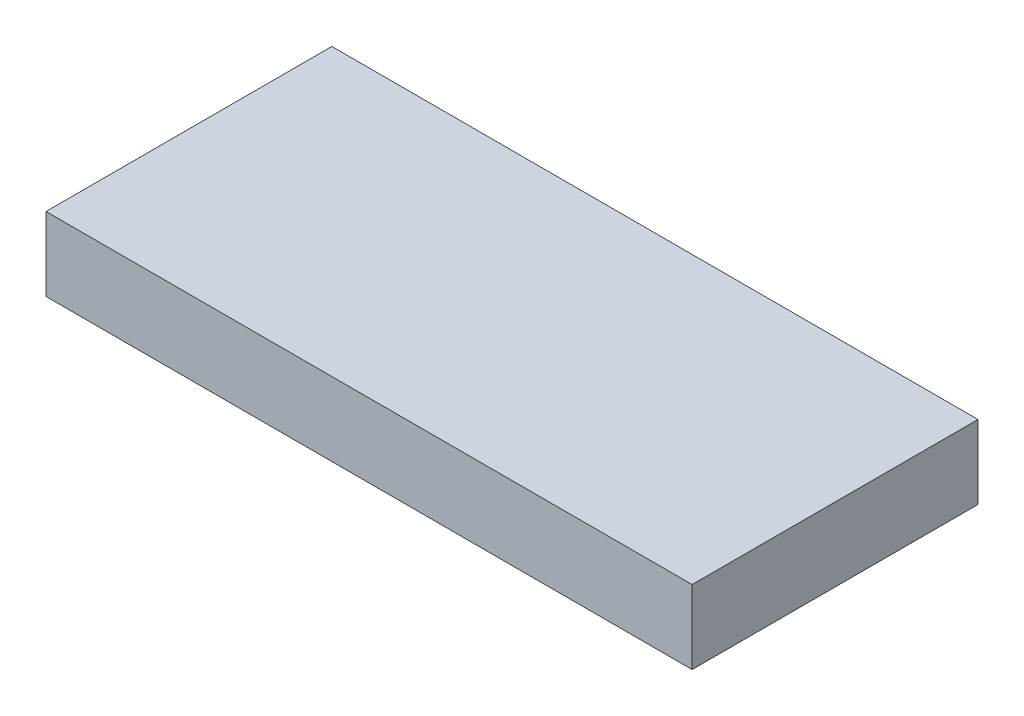
ISO-10303-21;
HEADER;
FILE_DESCRIPTION(('STEP AP214'),'2;1');
FILE_NAME('part.step','',(''),(''),'','','');
FILE_SCHEMA(('AUTOMOTIVE_DESIGN { 1 0 10303 214 1 1 1 1 }'));
ENDSEC;
DATA;
#1=APPLICATION_CONTEXT('core data for automotive mechanical design processes');
#2=APPLICATION_PROTOCOL_DEFINITION('international standard','automotive_design',2000,#1);
#3=PRODUCT_CONTEXT('',#1,'mechanical');
#4=PRODUCT('Part','Part','',(#3));
#5=PRODUCT_RELATED_PRODUCT_CATEGORY('part','',(#4));
#6=PRODUCT_DEFINITION_FORMATION('','',#4);
#7=PRODUCT_DEFINITION_CONTEXT('part definition',#1,'design');
#8=PRODUCT_DEFINITION('design','',#6,#7);
#9=PRODUCT_DEFINITION_SHAPE('','',#8);
#10=(LENGTH_UNIT() NAMED_UNIT(*) SI_UNIT(.MILLI.,.METRE.));
#11=(NAMED_UNIT(*) PLANE_ANGLE_UNIT() SI_UNIT($,.RADIAN.));
#12=(NAMED_UNIT(*) SI_UNIT($,.STERADIAN.) SOLID_ANGLE_UNIT());
#13=UNCERTAINTY_MEASURE_WITH_UNIT(LENGTH_MEASURE(1.E-05),#10,'distance_accuracy_value','');
#14=(GEOMETRIC_REPRESENTATION_CONTEXT(3) GLOBAL_UNCERTAINTY_ASSIGNED_CONTEXT((#13)) GLOBAL_UNIT_ASSIGNED_CONTEXT((#10,
#11,#12)) REPRESENTATION_CONTEXT('',''));
#15=CARTESIAN_POINT('',(0.,0.,0.));
#16=DIRECTION('',(0.,0.,1.));
#17=DIRECTION('',(1.,0.,0.));
#18=AXIS2_PLACEMENT_3D('',#15,#16,#17);
#19=CARTESIAN_POINT('',(-82.5,18.8,36.5));
#20=DIRECTION('',(1.,0.,0.));
#21=DIRECTION('',(0.,0.,-1.));
#22=AXIS2_PLACEMENT_3D('',#19,#20,#21);
#23=PLANE('',#22);
#24=DIRECTION('',(0.,0.,1.));
#25=VECTOR('',#24,1.);
#26=CARTESIAN_POINT('',(-82.5,0.,36.5));
#27=LINE('',#26,#25);
#28=CARTESIAN_POINT('',(-82.5,0.,-36.5));
#29=VERTEX_POINT('',#28);
#30=CARTESIAN_POINT('',(-82.5,0.,36.5));
#31=VERTEX_POINT('',#30);
#32=EDGE_CURVE('E96',#29,#31,#27,.T.);
#33=ORIENTED_EDGE('',*,*,#32,.T.);
#34=DIRECTION('',(0.,-1.,0.));
#35=VECTOR('',#34,1.);
#36=CARTESIAN_POINT('',(-82.5,18.8,36.5));
#37=LINE('',#36,#35);
#38=CARTESIAN_POINT('',(-82.5,18.8,36.5));
#39=VERTEX_POINT('',#38);
#40=EDGE_CURVE('E11',#39,#31,#37,.T.);
#41=ORIENTED_EDGE('',*,*,#40,.F.);
#42=DIRECTION('',(0.,0.,1.));
#43=VECTOR('',#42,1.);
#44=CARTESIAN_POINT('',(-82.5,18.8,36.5));
#45=LINE('',#44,#43);
#46=CARTESIAN_POINT('',(-82.5,18.8,-36.5));
#47=VERTEX_POINT('',#46);
#48=EDGE_CURVE('E84',#47,#39,#45,.T.);
#49=ORIENTED_EDGE('',*,*,#48,.F.);
#50=DIRECTION('',(0.,-1.,0.));
#51=VECTOR('',#50,1.);
#52=CARTESIAN_POINT('',(-82.5,18.8,-36.5));
#53=LINE('',#52,#51);
#54=EDGE_CURVE('E92',#47,#29,#53,.T.);
#55=ORIENTED_EDGE('',*,*,#54,.T.);
#56=EDGE_LOOP('',(#33,#41,#49,#55));
#57=FACE_BOUND('',#56,.T.);
#58=ADVANCED_FACE('F33',(#57),#23,.F.);
#59=CARTESIAN_POINT('',(-82.5,18.8,36.5));
#60=DIRECTION('',(0.,0.,-1.));
#61=DIRECTION('',(-1.,0.,0.));
#62=AXIS2_PLACEMENT_3D('',#59,#60,#61);
#63=PLANE('',#62);
#64=DIRECTION('',(1.,0.,0.));
#65=VECTOR('',#64,1.);
#66=CARTESIAN_POINT('',(-82.5,0.,36.5));
#67=LINE('',#66,#65);
#68=CARTESIAN_POINT('',(82.5,0.,36.5));
#69=VERTEX_POINT('',#68);
#70=EDGE_CURVE('E88',#31,#69,#67,.T.);
#71=ORIENTED_EDGE('',*,*,#70,.T.);
#72=DIRECTION('',(0.,-1.,0.));
#73=VECTOR('',#72,1.);
#74=CARTESIAN_POINT('',(82.5,18.8,36.5));
#75=LINE('',#74,#73);
#76=CARTESIAN_POINT('',(82.5,18.8,36.5));
#77=VERTEX_POINT('',#76);
#78=EDGE_CURVE('E41',#77,#69,#75,.T.);
#79=ORIENTED_EDGE('',*,*,#78,.F.);
#80=DIRECTION('',(1.,0.,0.));
#81=VECTOR('',#80,1.);
#82=CARTESIAN_POINT('',(-82.5,18.8,36.5));
#83=LINE('',#82,#81);
#84=EDGE_CURVE('E79',#39,#77,#83,.T.);
#85=ORIENTED_EDGE('',*,*,#84,.F.);
#86=ORIENTED_EDGE('',*,*,#40,.T.);
#87=EDGE_LOOP('',(#71,#79,#85,#86));
#88=FACE_BOUND('',#87,.T.);
#89=ADVANCED_FACE('F87',(#88),#63,.F.);
#90=CARTESIAN_POINT('',(82.5,18.8,36.5));
#91=DIRECTION('',(-1.,0.,0.));
#92=DIRECTION('',(0.,0.,1.));
#93=AXIS2_PLACEMENT_3D('',#90,#91,#92);
#94=PLANE('',#93);
#95=DIRECTION('',(0.,0.,-1.));
#96=VECTOR('',#95,1.);
#97=CARTESIAN_POINT('',(82.5,0.,36.5));
#98=LINE('',#97,#96);
#99=CARTESIAN_POINT('',(82.5,0.,-36.5));
#100=VERTEX_POINT('',#99);
#101=EDGE_CURVE('E66',#69,#100,#98,.T.);
#102=ORIENTED_EDGE('',*,*,#101,.T.);
#103=DIRECTION('',(0.,-1.,0.));
#104=VECTOR('',#103,1.);
#105=CARTESIAN_POINT('',(82.5,18.8,-36.5));
#106=LINE('',#105,#104);
#107=CARTESIAN_POINT('',(82.5,18.8,-36.5));
#108=VERTEX_POINT('',#107);
#109=EDGE_CURVE('E89',#108,#100,#106,.T.);
#110=ORIENTED_EDGE('',*,*,#109,.F.);
#111=DIRECTION('',(0.,0.,-1.));
#112=VECTOR('',#111,1.);
#113=CARTESIAN_POINT('',(82.5,18.8,36.5));
#114=LINE('',#113,#112);
#115=EDGE_CURVE('E82',#77,#108,#114,.T.);
#116=ORIENTED_EDGE('',*,*,#115,.F.);
#117=ORIENTED_EDGE('',*,*,#78,.T.);
#118=EDGE_LOOP('',(#102,#110,#116,#117));
#119=FACE_BOUND('',#118,.T.);
#120=ADVANCED_FACE('F90',(#119),#94,.F.);
#121=CARTESIAN_POINT('',(-82.5,18.8,-36.5));
#122=DIRECTION('',(0.,0.,1.));
#123=DIRECTION('',(1.,0.,0.));
#124=AXIS2_PLACEMENT_3D('',#121,#122,#123);
#125=PLANE('',#124);
#126=DIRECTION('',(-1.,0.,0.));
#127=VECTOR('',#126,1.);
#128=CARTESIAN_POINT('',(-82.5,0.,-36.5));
#129=LINE('',#128,#127);
#130=EDGE_CURVE('E72',#100,#29,#129,.T.);
#131=ORIENTED_EDGE('',*,*,#130,.T.);
#132=ORIENTED_EDGE('',*,*,#54,.F.);
#133=DIRECTION('',(-1.,0.,0.));
#134=VECTOR('',#133,1.);
#135=CARTESIAN_POINT('',(-82.5,18.8,-36.5));
#136=LINE('',#135,#134);
#137=EDGE_CURVE('E49',#108,#47,#136,.T.);
#138=ORIENTED_EDGE('',*,*,#137,.F.);
#139=ORIENTED_EDGE('',*,*,#109,.T.);
#140=EDGE_LOOP('',(#131,#132,#138,#139));
#141=FACE_BOUND('',#140,.T.);
#142=ADVANCED_FACE('F103',(#141),#125,.F.);
#143=CARTESIAN_POINT('',(0.,18.8,0.));
#144=DIRECTION('',(0.,-1.,0.));
#145=DIRECTION('',(0.,0.,-1.));
#146=AXIS2_PLACEMENT_3D('',#143,#144,#145);
#147=PLANE('',#146);
#148=ORIENTED_EDGE('',*,*,#48,.T.);
#149=ORIENTED_EDGE('',*,*,#84,.T.);
#150=ORIENTED_EDGE('',*,*,#115,.T.);
#151=ORIENTED_EDGE('',*,*,#137,.T.);
#152=EDGE_LOOP('',(#148,#149,#150,#151));
#153=FACE_BOUND('',#152,.T.);
#154=ADVANCED_FACE('F80',(#153),#147,.F.);
#155=CARTESIAN_POINT('',(0.,0.,0.));
#156=DIRECTION('',(0.,-1.,0.));
#157=DIRECTION('',(0.,0.,-1.));
#158=AXIS2_PLACEMENT_3D('',#155,#156,#157);
#159=PLANE('',#158);
#160=ORIENTED_EDGE('',*,*,#32,.F.);
#161=ORIENTED_EDGE('',*,*,#130,.F.);
#162=ORIENTED_EDGE('',*,*,#101,.F.);
#163=ORIENTED_EDGE('',*,*,#70,.F.);
#164=EDGE_LOOP('',(#160,#161,#162,#163));
#165=FACE_BOUND('',#164,.T.);
#166=ADVANCED_FACE('F106',(#165),#159,.T.);
#167=CLOSED_SHELL('',(#58,#89,#120,#142,#154,#166));
#168=MANIFOLD_SOLID_BREP('B2',#167);
#169=ADVANCED_BREP_SHAPE_REPRESENTATION('',(#18,#168),#14);
#170=SHAPE_DEFINITION_REPRESENTATION(#9,#169);
ENDSEC;
END-ISO-10303-21;
